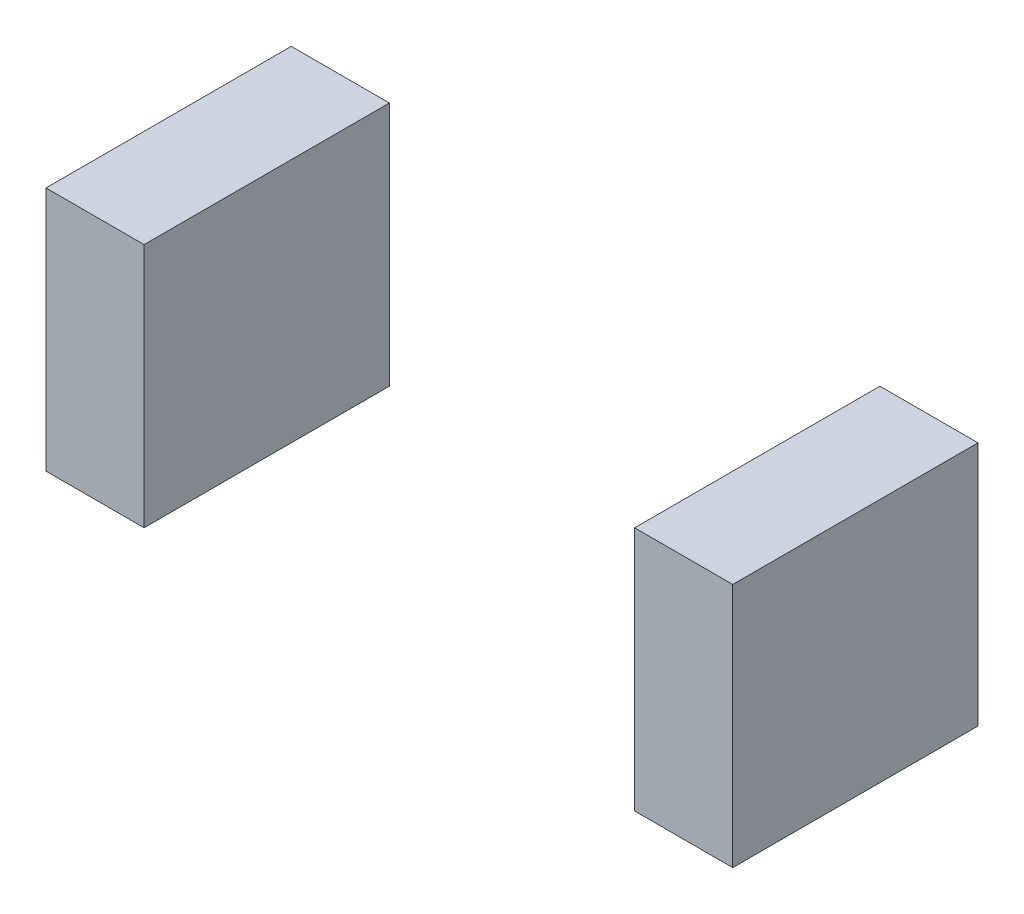
ISO-10303-21;
HEADER;
FILE_DESCRIPTION(('STEP AP214'),'2;1');
FILE_NAME('part.step','',(''),(''),'','','');
FILE_SCHEMA(('AUTOMOTIVE_DESIGN { 1 0 10303 214 1 1 1 1 }'));
ENDSEC;
DATA;
#1=APPLICATION_CONTEXT('core data for automotive mechanical design processes');
#2=APPLICATION_PROTOCOL_DEFINITION('international standard','automotive_design',2000,#1);
#3=PRODUCT_CONTEXT('',#1,'mechanical');
#4=PRODUCT('Part','Part','',(#3));
#5=PRODUCT_RELATED_PRODUCT_CATEGORY('part','',(#4));
#6=PRODUCT_DEFINITION_FORMATION('','',#4);
#7=PRODUCT_DEFINITION_CONTEXT('part definition',#1,'design');
#8=PRODUCT_DEFINITION('design','',#6,#7);
#9=PRODUCT_DEFINITION_SHAPE('','',#8);
#10=(LENGTH_UNIT() NAMED_UNIT(*) SI_UNIT(.MILLI.,.METRE.));
#11=(NAMED_UNIT(*) PLANE_ANGLE_UNIT() SI_UNIT($,.RADIAN.));
#12=(NAMED_UNIT(*) SI_UNIT($,.STERADIAN.) SOLID_ANGLE_UNIT());
#13=UNCERTAINTY_MEASURE_WITH_UNIT(LENGTH_MEASURE(1.E-05),#10,'distance_accuracy_value','');
#14=(GEOMETRIC_REPRESENTATION_CONTEXT(3) GLOBAL_UNCERTAINTY_ASSIGNED_CONTEXT((#13)) GLOBAL_UNIT_ASSIGNED_CONTEXT((#10,
#11,#12)) REPRESENTATION_CONTEXT('',''));
#15=CARTESIAN_POINT('',(0.,0.,0.));
#16=DIRECTION('',(0.,0.,1.));
#17=DIRECTION('',(1.,0.,0.));
#18=AXIS2_PLACEMENT_3D('',#15,#16,#17);
#19=CARTESIAN_POINT('',(120.,0.,50.));
#20=DIRECTION('',(1.,0.,0.));
#21=DIRECTION('',(0.,0.,-1.));
#22=AXIS2_PLACEMENT_3D('',#19,#20,#21);
#23=PLANE('',#22);
#24=DIRECTION('',(0.,-1.,0.));
#25=VECTOR('',#24,1.);
#26=CARTESIAN_POINT('',(120.,0.,0.));
#27=LINE('',#26,#25);
#28=CARTESIAN_POINT('',(120.,50.,0.));
#29=VERTEX_POINT('',#28);
#30=CARTESIAN_POINT('',(120.,0.,0.));
#31=VERTEX_POINT('',#30);
#32=EDGE_CURVE('E118',#29,#31,#27,.T.);
#33=ORIENTED_EDGE('',*,*,#32,.T.);
#34=DIRECTION('',(0.,0.,-1.));
#35=VECTOR('',#34,1.);
#36=CARTESIAN_POINT('',(120.,0.,50.));
#37=LINE('',#36,#35);
#38=CARTESIAN_POINT('',(120.,0.,50.));
#39=VERTEX_POINT('',#38);
#40=EDGE_CURVE('E12',#39,#31,#37,.T.);
#41=ORIENTED_EDGE('',*,*,#40,.F.);
#42=DIRECTION('',(0.,-1.,0.));
#43=VECTOR('',#42,1.);
#44=CARTESIAN_POINT('',(120.,0.,50.));
#45=LINE('',#44,#43);
#46=CARTESIAN_POINT('',(120.,50.,50.));
#47=VERTEX_POINT('',#46);
#48=EDGE_CURVE('E106',#47,#39,#45,.T.);
#49=ORIENTED_EDGE('',*,*,#48,.F.);
#50=DIRECTION('',(0.,0.,-1.));
#51=VECTOR('',#50,1.);
#52=CARTESIAN_POINT('',(120.,50.,50.));
#53=LINE('',#52,#51);
#54=EDGE_CURVE('E114',#47,#29,#53,.T.);
#55=ORIENTED_EDGE('',*,*,#54,.T.);
#56=EDGE_LOOP('',(#33,#41,#49,#55));
#57=FACE_BOUND('',#56,.T.);
#58=ADVANCED_FACE('F55',(#57),#23,.F.);
#59=CARTESIAN_POINT('',(120.,0.,50.));
#60=DIRECTION('',(0.,1.,0.));
#61=DIRECTION('',(0.,0.,1.));
#62=AXIS2_PLACEMENT_3D('',#59,#60,#61);
#63=PLANE('',#62);
#64=DIRECTION('',(1.,0.,0.));
#65=VECTOR('',#64,1.);
#66=CARTESIAN_POINT('',(120.,0.,0.));
#67=LINE('',#66,#65);
#68=CARTESIAN_POINT('',(140.,0.,0.));
#69=VERTEX_POINT('',#68);
#70=EDGE_CURVE('E110',#31,#69,#67,.T.);
#71=ORIENTED_EDGE('',*,*,#70,.T.);
#72=DIRECTION('',(0.,0.,-1.));
#73=VECTOR('',#72,1.);
#74=CARTESIAN_POINT('',(140.,0.,50.));
#75=LINE('',#74,#73);
#76=CARTESIAN_POINT('',(140.,0.,50.));
#77=VERTEX_POINT('',#76);
#78=EDGE_CURVE('E63',#77,#69,#75,.T.);
#79=ORIENTED_EDGE('',*,*,#78,.F.);
#80=DIRECTION('',(1.,0.,0.));
#81=VECTOR('',#80,1.);
#82=CARTESIAN_POINT('',(120.,0.,50.));
#83=LINE('',#82,#81);
#84=EDGE_CURVE('E101',#39,#77,#83,.T.);
#85=ORIENTED_EDGE('',*,*,#84,.F.);
#86=ORIENTED_EDGE('',*,*,#40,.T.);
#87=EDGE_LOOP('',(#71,#79,#85,#86));
#88=FACE_BOUND('',#87,.T.);
#89=ADVANCED_FACE('F109',(#88),#63,.F.);
#90=CARTESIAN_POINT('',(140.,0.,50.));
#91=DIRECTION('',(-1.,0.,0.));
#92=DIRECTION('',(0.,0.,1.));
#93=AXIS2_PLACEMENT_3D('',#90,#91,#92);
#94=PLANE('',#93);
#95=DIRECTION('',(0.,1.,0.));
#96=VECTOR('',#95,1.);
#97=CARTESIAN_POINT('',(140.,0.,0.));
#98=LINE('',#97,#96);
#99=CARTESIAN_POINT('',(140.,50.,0.));
#100=VERTEX_POINT('',#99);
#101=EDGE_CURVE('E88',#69,#100,#98,.T.);
#102=ORIENTED_EDGE('',*,*,#101,.T.);
#103=DIRECTION('',(0.,0.,-1.));
#104=VECTOR('',#103,1.);
#105=CARTESIAN_POINT('',(140.,50.,50.));
#106=LINE('',#105,#104);
#107=CARTESIAN_POINT('',(140.,50.,50.));
#108=VERTEX_POINT('',#107);
#109=EDGE_CURVE('E111',#108,#100,#106,.T.);
#110=ORIENTED_EDGE('',*,*,#109,.F.);
#111=DIRECTION('',(0.,1.,0.));
#112=VECTOR('',#111,1.);
#113=CARTESIAN_POINT('',(140.,0.,50.));
#114=LINE('',#113,#112);
#115=EDGE_CURVE('E104',#77,#108,#114,.T.);
#116=ORIENTED_EDGE('',*,*,#115,.F.);
#117=ORIENTED_EDGE('',*,*,#78,.T.);
#118=EDGE_LOOP('',(#102,#110,#116,#117));
#119=FACE_BOUND('',#118,.T.);
#120=ADVANCED_FACE('F112',(#119),#94,.F.);
#121=CARTESIAN_POINT('',(120.,50.,50.));
#122=DIRECTION('',(0.,-1.,0.));
#123=DIRECTION('',(0.,0.,-1.));
#124=AXIS2_PLACEMENT_3D('',#121,#122,#123);
#125=PLANE('',#124);
#126=DIRECTION('',(-1.,0.,0.));
#127=VECTOR('',#126,1.);
#128=CARTESIAN_POINT('',(120.,50.,0.));
#129=LINE('',#128,#127);
#130=EDGE_CURVE('E94',#100,#29,#129,.T.);
#131=ORIENTED_EDGE('',*,*,#130,.T.);
#132=ORIENTED_EDGE('',*,*,#54,.F.);
#133=DIRECTION('',(-1.,0.,0.));
#134=VECTOR('',#133,1.);
#135=CARTESIAN_POINT('',(120.,50.,50.));
#136=LINE('',#135,#134);
#137=EDGE_CURVE('E71',#108,#47,#136,.T.);
#138=ORIENTED_EDGE('',*,*,#137,.F.);
#139=ORIENTED_EDGE('',*,*,#109,.T.);
#140=EDGE_LOOP('',(#131,#132,#138,#139));
#141=FACE_BOUND('',#140,.T.);
#142=ADVANCED_FACE('F125',(#141),#125,.F.);
#143=CARTESIAN_POINT('',(120.,0.,50.));
#144=DIRECTION('',(0.,0.,-1.));
#145=DIRECTION('',(-1.,0.,0.));
#146=AXIS2_PLACEMENT_3D('',#143,#144,#145);
#147=PLANE('',#146);
#148=ORIENTED_EDGE('',*,*,#48,.T.);
#149=ORIENTED_EDGE('',*,*,#84,.T.);
#150=ORIENTED_EDGE('',*,*,#115,.T.);
#151=ORIENTED_EDGE('',*,*,#137,.T.);
#152=EDGE_LOOP('',(#148,#149,#150,#151));
#153=FACE_BOUND('',#152,.T.);
#154=ADVANCED_FACE('F102',(#153),#147,.F.);
#155=CARTESIAN_POINT('',(120.,0.,0.));
#156=DIRECTION('',(0.,0.,-1.));
#157=DIRECTION('',(-1.,0.,0.));
#158=AXIS2_PLACEMENT_3D('',#155,#156,#157);
#159=PLANE('',#158);
#160=ORIENTED_EDGE('',*,*,#32,.F.);
#161=ORIENTED_EDGE('',*,*,#130,.F.);
#162=ORIENTED_EDGE('',*,*,#101,.F.);
#163=ORIENTED_EDGE('',*,*,#70,.F.);
#164=EDGE_LOOP('',(#160,#161,#162,#163));
#165=FACE_BOUND('',#164,.T.);
#166=ADVANCED_FACE('F128',(#165),#159,.T.);
#167=CLOSED_SHELL('',(#58,#89,#120,#142,#154,#166));
#168=MANIFOLD_SOLID_BREP('B2',#167);
#169=CARTESIAN_POINT('',(0.,0.,50.));
#170=DIRECTION('',(1.,0.,0.));
#171=DIRECTION('',(0.,0.,-1.));
#172=AXIS2_PLACEMENT_3D('',#169,#170,#171);
#173=PLANE('',#172);
#174=DIRECTION('',(0.,-1.,0.));
#175=VECTOR('',#174,1.);
#176=CARTESIAN_POINT('',(0.,0.,0.));
#177=LINE('',#176,#175);
#178=CARTESIAN_POINT('',(0.,50.,0.));
#179=VERTEX_POINT('',#178);
#180=CARTESIAN_POINT('',(0.,0.,0.));
#181=VERTEX_POINT('',#180);
#182=EDGE_CURVE('E259',#179,#181,#177,.T.);
#183=ORIENTED_EDGE('',*,*,#182,.T.);
#184=DIRECTION('',(0.,0.,-1.));
#185=VECTOR('',#184,1.);
#186=CARTESIAN_POINT('',(0.,0.,50.));
#187=LINE('',#186,#185);
#188=CARTESIAN_POINT('',(0.,0.,50.));
#189=VERTEX_POINT('',#188);
#190=EDGE_CURVE('E53',#189,#181,#187,.T.);
#191=ORIENTED_EDGE('',*,*,#190,.F.);
#192=DIRECTION('',(0.,-1.,0.));
#193=VECTOR('',#192,1.);
#194=CARTESIAN_POINT('',(0.,0.,50.));
#195=LINE('',#194,#193);
#196=CARTESIAN_POINT('',(0.,50.,50.));
#197=VERTEX_POINT('',#196);
#198=EDGE_CURVE('E243',#197,#189,#195,.T.);
#199=ORIENTED_EDGE('',*,*,#198,.F.);
#200=DIRECTION('',(0.,0.,-1.));
#201=VECTOR('',#200,1.);
#202=CARTESIAN_POINT('',(0.,50.,50.));
#203=LINE('',#202,#201);
#204=EDGE_CURVE('E255',#197,#179,#203,.T.);
#205=ORIENTED_EDGE('',*,*,#204,.T.);
#206=EDGE_LOOP('',(#183,#191,#199,#205));
#207=FACE_BOUND('',#206,.T.);
#208=ADVANCED_FACE('F191',(#207),#173,.F.);
#209=CARTESIAN_POINT('',(0.,0.,50.));
#210=DIRECTION('',(0.,1.,0.));
#211=DIRECTION('',(0.,0.,1.));
#212=AXIS2_PLACEMENT_3D('',#209,#210,#211);
#213=PLANE('',#212);
#214=DIRECTION('',(1.,0.,0.));
#215=VECTOR('',#214,1.);
#216=CARTESIAN_POINT('',(0.,0.,0.));
#217=LINE('',#216,#215);
#218=CARTESIAN_POINT('',(20.,0.,0.));
#219=VERTEX_POINT('',#218);
#220=EDGE_CURVE('E248',#181,#219,#217,.T.);
#221=ORIENTED_EDGE('',*,*,#220,.T.);
#222=DIRECTION('',(0.,0.,-1.));
#223=VECTOR('',#222,1.);
#224=CARTESIAN_POINT('',(20.,0.,50.));
#225=LINE('',#224,#223);
#226=CARTESIAN_POINT('',(20.,0.,50.));
#227=VERTEX_POINT('',#226);
#228=EDGE_CURVE('E200',#227,#219,#225,.T.);
#229=ORIENTED_EDGE('',*,*,#228,.F.);
#230=DIRECTION('',(1.,0.,0.));
#231=VECTOR('',#230,1.);
#232=CARTESIAN_POINT('',(0.,0.,50.));
#233=LINE('',#232,#231);
#234=EDGE_CURVE('E238',#189,#227,#233,.T.);
#235=ORIENTED_EDGE('',*,*,#234,.F.);
#236=ORIENTED_EDGE('',*,*,#190,.T.);
#237=EDGE_LOOP('',(#221,#229,#235,#236));
#238=FACE_BOUND('',#237,.T.);
#239=ADVANCED_FACE('F247',(#238),#213,.F.);
#240=CARTESIAN_POINT('',(20.,0.,50.));
#241=DIRECTION('',(-1.,0.,0.));
#242=DIRECTION('',(0.,0.,1.));
#243=AXIS2_PLACEMENT_3D('',#240,#241,#242);
#244=PLANE('',#243);
#245=DIRECTION('',(0.,1.,0.));
#246=VECTOR('',#245,1.);
#247=CARTESIAN_POINT('',(20.,0.,0.));
#248=LINE('',#247,#246);
#249=CARTESIAN_POINT('',(20.,50.,0.));
#250=VERTEX_POINT('',#249);
#251=EDGE_CURVE('E225',#219,#250,#248,.T.);
#252=ORIENTED_EDGE('',*,*,#251,.T.);
#253=DIRECTION('',(0.,0.,-1.));
#254=VECTOR('',#253,1.);
#255=CARTESIAN_POINT('',(20.,50.,50.));
#256=LINE('',#255,#254);
#257=CARTESIAN_POINT('',(20.,50.,50.));
#258=VERTEX_POINT('',#257);
#259=EDGE_CURVE('E250',#258,#250,#256,.T.);
#260=ORIENTED_EDGE('',*,*,#259,.F.);
#261=DIRECTION('',(0.,1.,0.));
#262=VECTOR('',#261,1.);
#263=CARTESIAN_POINT('',(20.,0.,50.));
#264=LINE('',#263,#262);
#265=EDGE_CURVE('E241',#227,#258,#264,.T.);
#266=ORIENTED_EDGE('',*,*,#265,.F.);
#267=ORIENTED_EDGE('',*,*,#228,.T.);
#268=EDGE_LOOP('',(#252,#260,#266,#267));
#269=FACE_BOUND('',#268,.T.);
#270=ADVANCED_FACE('F251',(#269),#244,.F.);
#271=CARTESIAN_POINT('',(0.,50.,50.));
#272=DIRECTION('',(0.,-1.,0.));
#273=DIRECTION('',(0.,0.,-1.));
#274=AXIS2_PLACEMENT_3D('',#271,#272,#273);
#275=PLANE('',#274);
#276=DIRECTION('',(-1.,0.,0.));
#277=VECTOR('',#276,1.);
#278=CARTESIAN_POINT('',(0.,50.,0.));
#279=LINE('',#278,#277);
#280=EDGE_CURVE('E231',#250,#179,#279,.T.);
#281=ORIENTED_EDGE('',*,*,#280,.T.);
#282=ORIENTED_EDGE('',*,*,#204,.F.);
#283=DIRECTION('',(-1.,0.,0.));
#284=VECTOR('',#283,1.);
#285=CARTESIAN_POINT('',(0.,50.,50.));
#286=LINE('',#285,#284);
#287=EDGE_CURVE('E208',#258,#197,#286,.T.);
#288=ORIENTED_EDGE('',*,*,#287,.F.);
#289=ORIENTED_EDGE('',*,*,#259,.T.);
#290=EDGE_LOOP('',(#281,#282,#288,#289));
#291=FACE_BOUND('',#290,.T.);
#292=ADVANCED_FACE('F272',(#291),#275,.F.);
#293=CARTESIAN_POINT('',(0.,0.,50.));
#294=DIRECTION('',(0.,0.,-1.));
#295=DIRECTION('',(-1.,0.,0.));
#296=AXIS2_PLACEMENT_3D('',#293,#294,#295);
#297=PLANE('',#296);
#298=ORIENTED_EDGE('',*,*,#198,.T.);
#299=ORIENTED_EDGE('',*,*,#234,.T.);
#300=ORIENTED_EDGE('',*,*,#265,.T.);
#301=ORIENTED_EDGE('',*,*,#287,.T.);
#302=EDGE_LOOP('',(#298,#299,#300,#301));
#303=FACE_BOUND('',#302,.T.);
#304=ADVANCED_FACE('F239',(#303),#297,.F.);
#305=CARTESIAN_POINT('',(0.,0.,0.));
#306=DIRECTION('',(0.,0.,-1.));
#307=DIRECTION('',(-1.,0.,0.));
#308=AXIS2_PLACEMENT_3D('',#305,#306,#307);
#309=PLANE('',#308);
#310=ORIENTED_EDGE('',*,*,#182,.F.);
#311=ORIENTED_EDGE('',*,*,#280,.F.);
#312=ORIENTED_EDGE('',*,*,#251,.F.);
#313=ORIENTED_EDGE('',*,*,#220,.F.);
#314=EDGE_LOOP('',(#310,#311,#312,#313));
#315=FACE_BOUND('',#314,.T.);
#316=ADVANCED_FACE('F275',(#315),#309,.T.);
#317=CLOSED_SHELL('',(#208,#239,#270,#292,#304,#316));
#318=MANIFOLD_SOLID_BREP('B6',#317);
#319=ADVANCED_BREP_SHAPE_REPRESENTATION('',(#18,#168,#318),#14);
#320=SHAPE_DEFINITION_REPRESENTATION(#9,#319);
ENDSEC;
END-ISO-10303-21;
